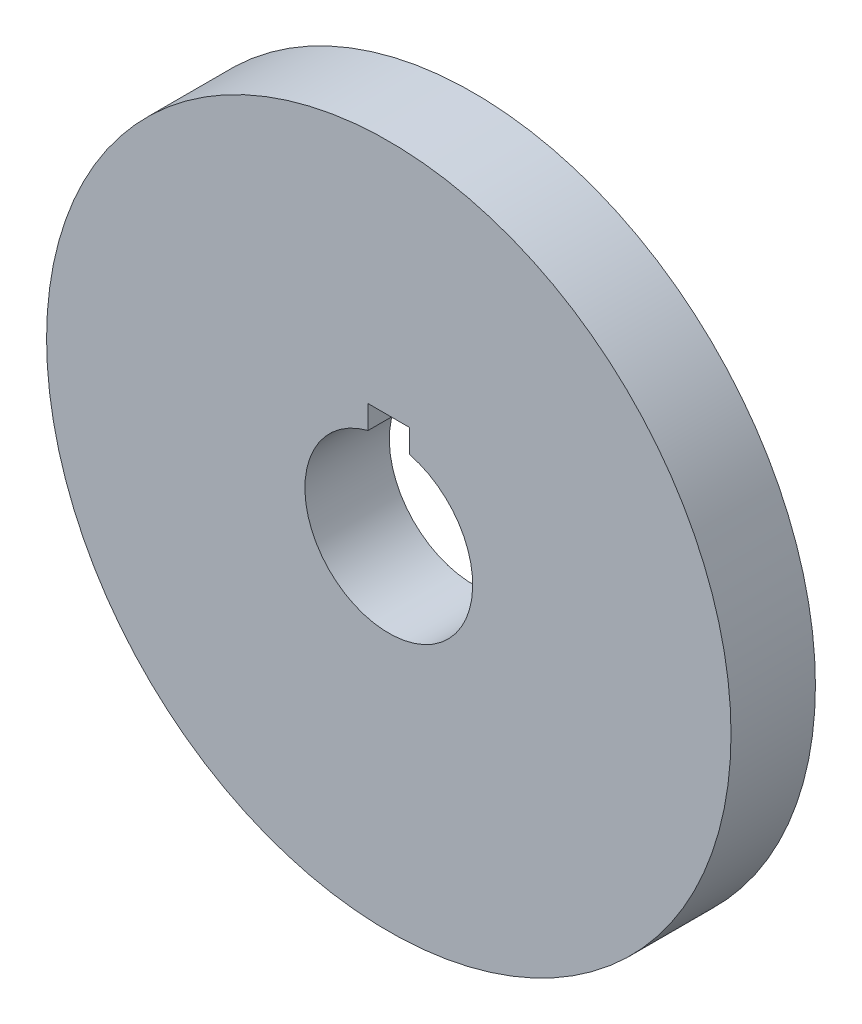
ISO-10303-21;
HEADER;
FILE_DESCRIPTION(('STEP AP214'),'2;1');
FILE_NAME('part.step','',(''),(''),'','','');
FILE_SCHEMA(('AUTOMOTIVE_DESIGN { 1 0 10303 214 1 1 1 1 }'));
ENDSEC;
DATA;
#1=APPLICATION_CONTEXT('core data for automotive mechanical design processes');
#2=APPLICATION_PROTOCOL_DEFINITION('international standard','automotive_design',2000,#1);
#3=PRODUCT_CONTEXT('',#1,'mechanical');
#4=PRODUCT('Part','Part','',(#3));
#5=PRODUCT_RELATED_PRODUCT_CATEGORY('part','',(#4));
#6=PRODUCT_DEFINITION_FORMATION('','',#4);
#7=PRODUCT_DEFINITION_CONTEXT('part definition',#1,'design');
#8=PRODUCT_DEFINITION('design','',#6,#7);
#9=PRODUCT_DEFINITION_SHAPE('','',#8);
#10=(LENGTH_UNIT() NAMED_UNIT(*) SI_UNIT(.MILLI.,.METRE.));
#11=(NAMED_UNIT(*) PLANE_ANGLE_UNIT() SI_UNIT($,.RADIAN.));
#12=(NAMED_UNIT(*) SI_UNIT($,.STERADIAN.) SOLID_ANGLE_UNIT());
#13=UNCERTAINTY_MEASURE_WITH_UNIT(LENGTH_MEASURE(1.E-05),#10,'distance_accuracy_value','');
#14=(GEOMETRIC_REPRESENTATION_CONTEXT(3) GLOBAL_UNCERTAINTY_ASSIGNED_CONTEXT((#13)) GLOBAL_UNIT_ASSIGNED_CONTEXT((#10,
#11,#12)) REPRESENTATION_CONTEXT('',''));
#15=CARTESIAN_POINT('',(0.,0.,0.));
#16=DIRECTION('',(0.,0.,1.));
#17=DIRECTION('',(1.,0.,0.));
#18=AXIS2_PLACEMENT_3D('',#15,#16,#17);
#19=CARTESIAN_POINT('',(0.,0.,6.35));
#20=DIRECTION('',(0.,0.,1.));
#21=DIRECTION('',(1.,0.,0.));
#22=AXIS2_PLACEMENT_3D('',#19,#20,#21);
#23=PLANE('',#22);
#24=CARTESIAN_POINT('',(0.,0.,6.35));
#25=DIRECTION('',(0.,0.,1.));
#26=DIRECTION('',(1.,0.,0.));
#27=AXIS2_PLACEMENT_3D('',#24,#25,#26);
#28=CIRCLE('',#27,25.75);
#29=CARTESIAN_POINT('',(25.75,0.,6.35));
#30=VERTEX_POINT('',#29);
#31=EDGE_CURVE('E11',#30,#30,#28,.T.);
#32=ORIENTED_EDGE('',*,*,#31,.T.);
#33=EDGE_LOOP('',(#32));
#34=FACE_BOUND('',#33,.T.);
#35=CARTESIAN_POINT('',(0.,0.,6.35));
#36=DIRECTION('',(0.,0.,1.));
#37=DIRECTION('',(1.,0.,0.));
#38=AXIS2_PLACEMENT_3D('',#35,#36,#37);
#39=CIRCLE('',#38,6.3125);
#40=CARTESIAN_POINT('',(-1.5625,6.11606491136253,6.35));
#41=VERTEX_POINT('',#40);
#42=CARTESIAN_POINT('',(1.5625,6.11606491136253,6.35));
#43=VERTEX_POINT('',#42);
#44=EDGE_CURVE('E82',#41,#43,#39,.T.);
#45=ORIENTED_EDGE('',*,*,#44,.F.);
#46=DIRECTION('',(0.,-1.,0.));
#47=VECTOR('',#46,1.);
#48=CARTESIAN_POINT('',(-1.5625,7.875,6.35));
#49=LINE('',#48,#47);
#50=CARTESIAN_POINT('',(-1.5625,7.875,6.35));
#51=VERTEX_POINT('',#50);
#52=EDGE_CURVE('E74',#51,#41,#49,.T.);
#53=ORIENTED_EDGE('',*,*,#52,.F.);
#54=DIRECTION('',(-1.,0.,0.));
#55=VECTOR('',#54,1.);
#56=CARTESIAN_POINT('',(-1.5625,7.875,6.35));
#57=LINE('',#56,#55);
#58=CARTESIAN_POINT('',(1.5625,7.875,6.35));
#59=VERTEX_POINT('',#58);
#60=EDGE_CURVE('E95',#59,#51,#57,.T.);
#61=ORIENTED_EDGE('',*,*,#60,.F.);
#62=DIRECTION('',(0.,1.,0.));
#63=VECTOR('',#62,1.);
#64=CARTESIAN_POINT('',(1.5625,7.875,6.35));
#65=LINE('',#64,#63);
#66=EDGE_CURVE('E93',#43,#59,#65,.T.);
#67=ORIENTED_EDGE('',*,*,#66,.F.);
#68=EDGE_LOOP('',(#45,#53,#61,#67));
#69=FACE_BOUND('',#68,.T.);
#70=ADVANCED_FACE('F33',(#34,#69),#23,.T.);
#71=CARTESIAN_POINT('',(0.,0.,0.));
#72=DIRECTION('',(0.,0.,1.));
#73=DIRECTION('',(1.,0.,0.));
#74=AXIS2_PLACEMENT_3D('',#71,#72,#73);
#75=PLANE('',#74);
#76=CARTESIAN_POINT('',(0.,0.,0.));
#77=DIRECTION('',(0.,0.,1.));
#78=DIRECTION('',(1.,0.,0.));
#79=AXIS2_PLACEMENT_3D('',#76,#77,#78);
#80=CIRCLE('',#79,25.75);
#81=CARTESIAN_POINT('',(25.75,0.,0.));
#82=VERTEX_POINT('',#81);
#83=EDGE_CURVE('E37',#82,#82,#80,.T.);
#84=ORIENTED_EDGE('',*,*,#83,.F.);
#85=EDGE_LOOP('',(#84));
#86=FACE_BOUND('',#85,.T.);
#87=DIRECTION('',(0.,-1.,0.));
#88=VECTOR('',#87,1.);
#89=CARTESIAN_POINT('',(-1.5625,7.875,0.));
#90=LINE('',#89,#88);
#91=CARTESIAN_POINT('',(-1.5625,7.875,0.));
#92=VERTEX_POINT('',#91);
#93=CARTESIAN_POINT('',(-1.5625,6.11606491136253,0.));
#94=VERTEX_POINT('',#93);
#95=EDGE_CURVE('E56',#92,#94,#90,.T.);
#96=ORIENTED_EDGE('',*,*,#95,.T.);
#97=CARTESIAN_POINT('',(0.,0.,0.));
#98=DIRECTION('',(0.,0.,1.));
#99=DIRECTION('',(1.,0.,0.));
#100=AXIS2_PLACEMENT_3D('',#97,#98,#99);
#101=CIRCLE('',#100,6.3125);
#102=CARTESIAN_POINT('',(1.5625,6.11606491136253,0.));
#103=VERTEX_POINT('',#102);
#104=EDGE_CURVE('E89',#94,#103,#101,.T.);
#105=ORIENTED_EDGE('',*,*,#104,.T.);
#106=DIRECTION('',(0.,1.,0.));
#107=VECTOR('',#106,1.);
#108=CARTESIAN_POINT('',(1.5625,7.875,0.));
#109=LINE('',#108,#107);
#110=CARTESIAN_POINT('',(1.5625,7.875,0.));
#111=VERTEX_POINT('',#110);
#112=EDGE_CURVE('E101',#103,#111,#109,.T.);
#113=ORIENTED_EDGE('',*,*,#112,.T.);
#114=DIRECTION('',(-1.,0.,0.));
#115=VECTOR('',#114,1.);
#116=CARTESIAN_POINT('',(-1.5625,7.875,0.));
#117=LINE('',#116,#115);
#118=EDGE_CURVE('E83',#111,#92,#117,.T.);
#119=ORIENTED_EDGE('',*,*,#118,.T.);
#120=EDGE_LOOP('',(#96,#105,#113,#119));
#121=FACE_BOUND('',#120,.T.);
#122=ADVANCED_FACE('F112',(#86,#121),#75,.F.);
#123=CARTESIAN_POINT('',(0.,0.,6.35));
#124=DIRECTION('',(0.,0.,-1.));
#125=DIRECTION('',(-1.,0.,0.));
#126=AXIS2_PLACEMENT_3D('',#123,#124,#125);
#127=CYLINDRICAL_SURFACE('',#126,25.75);
#128=ORIENTED_EDGE('',*,*,#31,.F.);
#129=EDGE_LOOP('',(#128));
#130=FACE_BOUND('',#129,.T.);
#131=ORIENTED_EDGE('',*,*,#83,.T.);
#132=EDGE_LOOP('',(#131));
#133=FACE_BOUND('',#132,.T.);
#134=ADVANCED_FACE('F35',(#130,#133),#127,.T.);
#135=CARTESIAN_POINT('',(-1.5625,7.875,6.35));
#136=DIRECTION('',(1.,0.,0.));
#137=DIRECTION('',(0.,1.,0.));
#138=AXIS2_PLACEMENT_3D('',#135,#136,#137);
#139=PLANE('',#138);
#140=ORIENTED_EDGE('',*,*,#95,.F.);
#141=DIRECTION('',(0.,0.,-1.));
#142=VECTOR('',#141,1.);
#143=CARTESIAN_POINT('',(-1.5625,7.875,6.35));
#144=LINE('',#143,#142);
#145=EDGE_CURVE('E78',#51,#92,#144,.T.);
#146=ORIENTED_EDGE('',*,*,#145,.F.);
#147=ORIENTED_EDGE('',*,*,#52,.T.);
#148=DIRECTION('',(0.,0.,-1.));
#149=VECTOR('',#148,1.);
#150=CARTESIAN_POINT('',(-1.5625,6.11606491136253,6.35));
#151=LINE('',#150,#149);
#152=EDGE_CURVE('E77',#41,#94,#151,.T.);
#153=ORIENTED_EDGE('',*,*,#152,.T.);
#154=EDGE_LOOP('',(#140,#146,#147,#153));
#155=FACE_BOUND('',#154,.T.);
#156=ADVANCED_FACE('F76',(#155),#139,.T.);
#157=CARTESIAN_POINT('',(0.,0.,6.35));
#158=DIRECTION('',(0.,0.,-1.));
#159=DIRECTION('',(-1.,0.,0.));
#160=AXIS2_PLACEMENT_3D('',#157,#158,#159);
#161=CYLINDRICAL_SURFACE('',#160,6.3125);
#162=ORIENTED_EDGE('',*,*,#104,.F.);
#163=ORIENTED_EDGE('',*,*,#152,.F.);
#164=ORIENTED_EDGE('',*,*,#44,.T.);
#165=DIRECTION('',(0.,0.,-1.));
#166=VECTOR('',#165,1.);
#167=CARTESIAN_POINT('',(1.5625,6.11606491136253,6.35));
#168=LINE('',#167,#166);
#169=EDGE_CURVE('E90',#43,#103,#168,.T.);
#170=ORIENTED_EDGE('',*,*,#169,.T.);
#171=EDGE_LOOP('',(#162,#163,#164,#170));
#172=FACE_BOUND('',#171,.T.);
#173=ADVANCED_FACE('F86',(#172),#161,.F.);
#174=CARTESIAN_POINT('',(1.5625,7.875,6.35));
#175=DIRECTION('',(-1.,0.,0.));
#176=DIRECTION('',(0.,-1.,0.));
#177=AXIS2_PLACEMENT_3D('',#174,#175,#176);
#178=PLANE('',#177);
#179=ORIENTED_EDGE('',*,*,#112,.F.);
#180=ORIENTED_EDGE('',*,*,#169,.F.);
#181=ORIENTED_EDGE('',*,*,#66,.T.);
#182=DIRECTION('',(0.,0.,-1.));
#183=VECTOR('',#182,1.);
#184=CARTESIAN_POINT('',(1.5625,7.875,6.35));
#185=LINE('',#184,#183);
#186=EDGE_CURVE('E48',#59,#111,#185,.T.);
#187=ORIENTED_EDGE('',*,*,#186,.T.);
#188=EDGE_LOOP('',(#179,#180,#181,#187));
#189=FACE_BOUND('',#188,.T.);
#190=ADVANCED_FACE('F110',(#189),#178,.T.);
#191=CARTESIAN_POINT('',(-1.5625,7.875,6.35));
#192=DIRECTION('',(0.,-1.,0.));
#193=DIRECTION('',(0.,0.,-1.));
#194=AXIS2_PLACEMENT_3D('',#191,#192,#193);
#195=PLANE('',#194);
#196=ORIENTED_EDGE('',*,*,#118,.F.);
#197=ORIENTED_EDGE('',*,*,#186,.F.);
#198=ORIENTED_EDGE('',*,*,#60,.T.);
#199=ORIENTED_EDGE('',*,*,#145,.T.);
#200=EDGE_LOOP('',(#196,#197,#198,#199));
#201=FACE_BOUND('',#200,.T.);
#202=ADVANCED_FACE('F113',(#201),#195,.T.);
#203=CLOSED_SHELL('',(#70,#122,#134,#156,#173,#190,#202));
#204=MANIFOLD_SOLID_BREP('B2',#203);
#205=ADVANCED_BREP_SHAPE_REPRESENTATION('',(#18,#204),#14);
#206=SHAPE_DEFINITION_REPRESENTATION(#9,#205);
ENDSEC;
END-ISO-10303-21;
